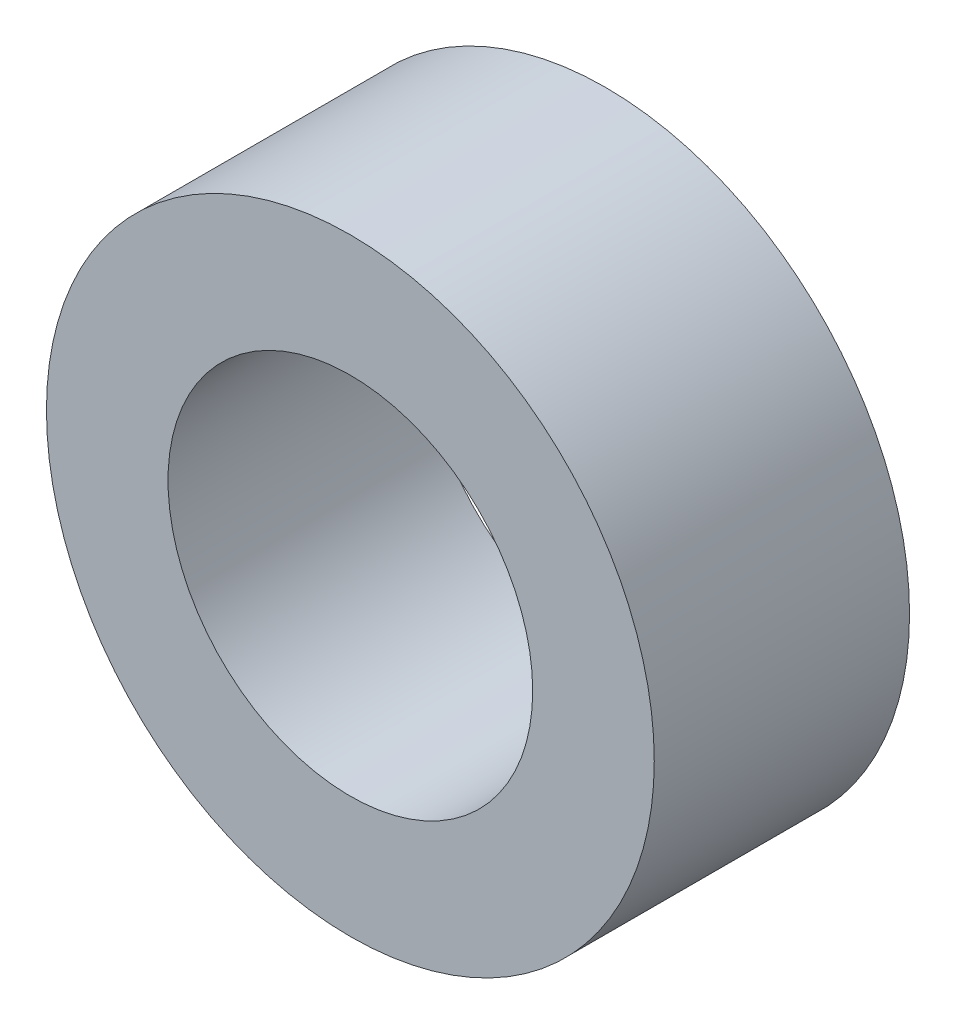
ISO-10303-21;
HEADER;
FILE_DESCRIPTION(('STEP AP214'),'2;1');
FILE_NAME('part.step','',(''),(''),'','','');
FILE_SCHEMA(('AUTOMOTIVE_DESIGN { 1 0 10303 214 1 1 1 1 }'));
ENDSEC;
DATA;
#1=APPLICATION_CONTEXT('core data for automotive mechanical design processes');
#2=APPLICATION_PROTOCOL_DEFINITION('international standard','automotive_design',2000,#1);
#3=PRODUCT_CONTEXT('',#1,'mechanical');
#4=PRODUCT('Part','Part','',(#3));
#5=PRODUCT_RELATED_PRODUCT_CATEGORY('part','',(#4));
#6=PRODUCT_DEFINITION_FORMATION('','',#4);
#7=PRODUCT_DEFINITION_CONTEXT('part definition',#1,'design');
#8=PRODUCT_DEFINITION('design','',#6,#7);
#9=PRODUCT_DEFINITION_SHAPE('','',#8);
#10=(LENGTH_UNIT() NAMED_UNIT(*) SI_UNIT(.MILLI.,.METRE.));
#11=(NAMED_UNIT(*) PLANE_ANGLE_UNIT() SI_UNIT($,.RADIAN.));
#12=(NAMED_UNIT(*) SI_UNIT($,.STERADIAN.) SOLID_ANGLE_UNIT());
#13=UNCERTAINTY_MEASURE_WITH_UNIT(LENGTH_MEASURE(1.E-05),#10,'distance_accuracy_value','');
#14=(GEOMETRIC_REPRESENTATION_CONTEXT(3) GLOBAL_UNCERTAINTY_ASSIGNED_CONTEXT((#13)) GLOBAL_UNIT_ASSIGNED_CONTEXT((#10,
#11,#12)) REPRESENTATION_CONTEXT('',''));
#15=CARTESIAN_POINT('',(0.,0.,0.));
#16=DIRECTION('',(0.,0.,1.));
#17=DIRECTION('',(1.,0.,0.));
#18=AXIS2_PLACEMENT_3D('',#15,#16,#17);
#19=CARTESIAN_POINT('',(0.,0.,2.1));
#20=DIRECTION('',(0.,0.,1.));
#21=DIRECTION('',(1.,0.,0.));
#22=AXIS2_PLACEMENT_3D('',#19,#20,#21);
#23=PLANE('',#22);
#24=CARTESIAN_POINT('',(0.,0.,2.1));
#25=DIRECTION('',(0.,0.,1.));
#26=DIRECTION('',(1.,0.,0.));
#27=AXIS2_PLACEMENT_3D('',#24,#25,#26);
#28=CIRCLE('',#27,2.5);
#29=CARTESIAN_POINT('',(2.5,0.,2.1));
#30=VERTEX_POINT('',#29);
#31=EDGE_CURVE('E10',#30,#30,#28,.T.);
#32=ORIENTED_EDGE('',*,*,#31,.T.);
#33=EDGE_LOOP('',(#32));
#34=FACE_BOUND('',#33,.T.);
#35=CARTESIAN_POINT('',(0.,0.,2.1));
#36=DIRECTION('',(0.,0.,1.));
#37=DIRECTION('',(1.,0.,0.));
#38=AXIS2_PLACEMENT_3D('',#35,#36,#37);
#39=CIRCLE('',#38,1.5);
#40=CARTESIAN_POINT('',(1.5,0.,2.1));
#41=VERTEX_POINT('',#40);
#42=EDGE_CURVE('E48',#41,#41,#39,.T.);
#43=ORIENTED_EDGE('',*,*,#42,.F.);
#44=EDGE_LOOP('',(#43));
#45=FACE_BOUND('',#44,.T.);
#46=ADVANCED_FACE('F37',(#34,#45),#23,.T.);
#47=CARTESIAN_POINT('',(0.,0.,0.));
#48=DIRECTION('',(0.,0.,1.));
#49=DIRECTION('',(1.,0.,0.));
#50=AXIS2_PLACEMENT_3D('',#47,#48,#49);
#51=PLANE('',#50);
#52=CARTESIAN_POINT('',(0.,0.,0.));
#53=DIRECTION('',(0.,0.,1.));
#54=DIRECTION('',(1.,0.,0.));
#55=AXIS2_PLACEMENT_3D('',#52,#53,#54);
#56=CIRCLE('',#55,2.5);
#57=CARTESIAN_POINT('',(2.5,0.,0.));
#58=VERTEX_POINT('',#57);
#59=EDGE_CURVE('E41',#58,#58,#56,.T.);
#60=ORIENTED_EDGE('',*,*,#59,.F.);
#61=EDGE_LOOP('',(#60));
#62=FACE_BOUND('',#61,.T.);
#63=CARTESIAN_POINT('',(0.,0.,0.));
#64=DIRECTION('',(0.,0.,1.));
#65=DIRECTION('',(1.,0.,0.));
#66=AXIS2_PLACEMENT_3D('',#63,#64,#65);
#67=CIRCLE('',#66,1.5);
#68=CARTESIAN_POINT('',(1.5,0.,0.));
#69=VERTEX_POINT('',#68);
#70=EDGE_CURVE('E50',#69,#69,#67,.T.);
#71=ORIENTED_EDGE('',*,*,#70,.T.);
#72=EDGE_LOOP('',(#71));
#73=FACE_BOUND('',#72,.T.);
#74=ADVANCED_FACE('F60',(#62,#73),#51,.F.);
#75=CARTESIAN_POINT('',(0.,0.,2.1));
#76=DIRECTION('',(0.,0.,-1.));
#77=DIRECTION('',(-1.,0.,0.));
#78=AXIS2_PLACEMENT_3D('',#75,#76,#77);
#79=CYLINDRICAL_SURFACE('',#78,2.5);
#80=ORIENTED_EDGE('',*,*,#31,.F.);
#81=EDGE_LOOP('',(#80));
#82=FACE_BOUND('',#81,.T.);
#83=ORIENTED_EDGE('',*,*,#59,.T.);
#84=EDGE_LOOP('',(#83));
#85=FACE_BOUND('',#84,.T.);
#86=ADVANCED_FACE('F39',(#82,#85),#79,.T.);
#87=CARTESIAN_POINT('',(0.,0.,2.1));
#88=DIRECTION('',(0.,0.,-1.));
#89=DIRECTION('',(-1.,0.,0.));
#90=AXIS2_PLACEMENT_3D('',#87,#88,#89);
#91=CYLINDRICAL_SURFACE('',#90,1.5);
#92=ORIENTED_EDGE('',*,*,#42,.T.);
#93=EDGE_LOOP('',(#92));
#94=FACE_BOUND('',#93,.T.);
#95=ORIENTED_EDGE('',*,*,#70,.F.);
#96=EDGE_LOOP('',(#95));
#97=FACE_BOUND('',#96,.T.);
#98=ADVANCED_FACE('F56',(#94,#97),#91,.F.);
#99=CLOSED_SHELL('',(#46,#74,#86,#98));
#100=MANIFOLD_SOLID_BREP('B2',#99);
#101=ADVANCED_BREP_SHAPE_REPRESENTATION('',(#18,#100),#14);
#102=SHAPE_DEFINITION_REPRESENTATION(#9,#101);
ENDSEC;
END-ISO-10303-21;
